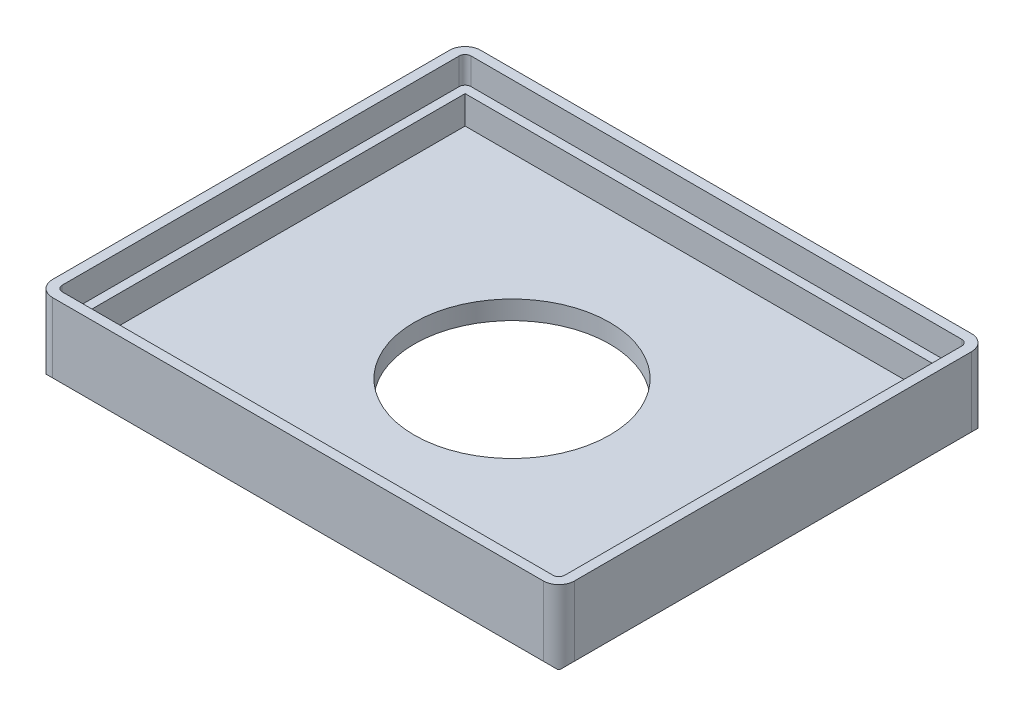
ISO-10303-21;
HEADER;
FILE_DESCRIPTION(('STEP AP214'),'2;1');
FILE_NAME('part.step','',(''),(''),'','','');
FILE_SCHEMA(('AUTOMOTIVE_DESIGN { 1 0 10303 214 1 1 1 1 }'));
ENDSEC;
DATA;
#1=APPLICATION_CONTEXT('core data for automotive mechanical design processes');
#2=APPLICATION_PROTOCOL_DEFINITION('international standard','automotive_design',2000,#1);
#3=PRODUCT_CONTEXT('',#1,'mechanical');
#4=PRODUCT('Part','Part','',(#3));
#5=PRODUCT_RELATED_PRODUCT_CATEGORY('part','',(#4));
#6=PRODUCT_DEFINITION_FORMATION('','',#4);
#7=PRODUCT_DEFINITION_CONTEXT('part definition',#1,'design');
#8=PRODUCT_DEFINITION('design','',#6,#7);
#9=PRODUCT_DEFINITION_SHAPE('','',#8);
#10=(LENGTH_UNIT() NAMED_UNIT(*) SI_UNIT(.MILLI.,.METRE.));
#11=(NAMED_UNIT(*) PLANE_ANGLE_UNIT() SI_UNIT($,.RADIAN.));
#12=(NAMED_UNIT(*) SI_UNIT($,.STERADIAN.) SOLID_ANGLE_UNIT());
#13=UNCERTAINTY_MEASURE_WITH_UNIT(LENGTH_MEASURE(1.E-05),#10,'distance_accuracy_value','');
#14=(GEOMETRIC_REPRESENTATION_CONTEXT(3) GLOBAL_UNCERTAINTY_ASSIGNED_CONTEXT((#13)) GLOBAL_UNIT_ASSIGNED_CONTEXT((#10,
#11,#12)) REPRESENTATION_CONTEXT('',''));
#15=CARTESIAN_POINT('',(0.,0.,0.));
#16=DIRECTION('',(0.,0.,1.));
#17=DIRECTION('',(1.,0.,0.));
#18=AXIS2_PLACEMENT_3D('',#15,#16,#17);
#19=CARTESIAN_POINT('',(0.,6.,0.));
#20=DIRECTION('',(0.,1.,0.));
#21=DIRECTION('',(0.,0.,1.));
#22=AXIS2_PLACEMENT_3D('',#19,#20,#21);
#23=PLANE('',#22);
#24=DIRECTION('',(1.,0.,0.));
#25=VECTOR('',#24,1.);
#26=CARTESIAN_POINT('',(-33.4,6.,25.));
#27=LINE('',#26,#25);
#28=CARTESIAN_POINT('',(-31.,6.,25.));
#29=VERTEX_POINT('',#28);
#30=CARTESIAN_POINT('',(31.,6.,25.));
#31=VERTEX_POINT('',#30);
#32=EDGE_CURVE('E297',#29,#31,#27,.T.);
#33=ORIENTED_EDGE('',*,*,#32,.F.);
#34=DIRECTION('',(0.,0.,1.));
#35=VECTOR('',#34,1.);
#36=CARTESIAN_POINT('',(-31.,6.,-27.4));
#37=LINE('',#36,#35);
#38=CARTESIAN_POINT('',(-31.,6.,-25.));
#39=VERTEX_POINT('',#38);
#40=EDGE_CURVE('E305',#39,#29,#37,.T.);
#41=ORIENTED_EDGE('',*,*,#40,.F.);
#42=DIRECTION('',(-1.,0.,0.));
#43=VECTOR('',#42,1.);
#44=CARTESIAN_POINT('',(-33.4,6.,-25.));
#45=LINE('',#44,#43);
#46=CARTESIAN_POINT('',(31.,6.,-25.));
#47=VERTEX_POINT('',#46);
#48=EDGE_CURVE('E58',#47,#39,#45,.T.);
#49=ORIENTED_EDGE('',*,*,#48,.F.);
#50=DIRECTION('',(0.,0.,-1.));
#51=VECTOR('',#50,1.);
#52=CARTESIAN_POINT('',(31.,6.,-27.4));
#53=LINE('',#52,#51);
#54=EDGE_CURVE('E291',#31,#47,#53,.T.);
#55=ORIENTED_EDGE('',*,*,#54,.F.);
#56=EDGE_LOOP('',(#33,#41,#49,#55));
#57=FACE_BOUND('',#56,.T.);
#58=DIRECTION('',(0.,0.,1.));
#59=VECTOR('',#58,1.);
#60=CARTESIAN_POINT('',(-32.15,6.,-25.4));
#61=LINE('',#60,#59);
#62=CARTESIAN_POINT('',(-32.15,6.,-25.4));
#63=VERTEX_POINT('',#62);
#64=CARTESIAN_POINT('',(-32.15,6.,25.4));
#65=VERTEX_POINT('',#64);
#66=EDGE_CURVE('E206',#63,#65,#61,.T.);
#67=ORIENTED_EDGE('',*,*,#66,.T.);
#68=CARTESIAN_POINT('',(-31.4,6.,25.4));
#69=DIRECTION('',(0.,1.,0.));
#70=DIRECTION('',(0.,0.,1.));
#71=AXIS2_PLACEMENT_3D('',#68,#69,#70);
#72=CIRCLE('',#71,0.750000000000001);
#73=CARTESIAN_POINT('',(-31.4,6.,26.15));
#74=VERTEX_POINT('',#73);
#75=EDGE_CURVE('E235',#65,#74,#72,.T.);
#76=ORIENTED_EDGE('',*,*,#75,.T.);
#77=DIRECTION('',(1.,0.,0.));
#78=VECTOR('',#77,1.);
#79=CARTESIAN_POINT('',(-31.4,6.,26.15));
#80=LINE('',#79,#78);
#81=CARTESIAN_POINT('',(31.4,6.,26.15));
#82=VERTEX_POINT('',#81);
#83=EDGE_CURVE('E212',#74,#82,#80,.T.);
#84=ORIENTED_EDGE('',*,*,#83,.T.);
#85=CARTESIAN_POINT('',(31.4,6.,25.4));
#86=DIRECTION('',(0.,1.,0.));
#87=DIRECTION('',(0.,0.,1.));
#88=AXIS2_PLACEMENT_3D('',#85,#86,#87);
#89=CIRCLE('',#88,0.749999999999997);
#90=CARTESIAN_POINT('',(32.15,6.,25.4));
#91=VERTEX_POINT('',#90);
#92=EDGE_CURVE('E239',#82,#91,#89,.T.);
#93=ORIENTED_EDGE('',*,*,#92,.T.);
#94=DIRECTION('',(0.,0.,-1.));
#95=VECTOR('',#94,1.);
#96=CARTESIAN_POINT('',(32.15,6.,25.4));
#97=LINE('',#96,#95);
#98=CARTESIAN_POINT('',(32.15,6.,-25.4));
#99=VERTEX_POINT('',#98);
#100=EDGE_CURVE('E242',#91,#99,#97,.T.);
#101=ORIENTED_EDGE('',*,*,#100,.T.);
#102=CARTESIAN_POINT('',(31.4,6.,-25.4));
#103=DIRECTION('',(0.,1.,0.));
#104=DIRECTION('',(0.,0.,1.));
#105=AXIS2_PLACEMENT_3D('',#102,#103,#104);
#106=CIRCLE('',#105,0.750000000000001);
#107=CARTESIAN_POINT('',(31.4,6.,-26.15));
#108=VERTEX_POINT('',#107);
#109=EDGE_CURVE('E245',#99,#108,#106,.T.);
#110=ORIENTED_EDGE('',*,*,#109,.T.);
#111=DIRECTION('',(-1.,0.,0.));
#112=VECTOR('',#111,1.);
#113=CARTESIAN_POINT('',(31.4,6.,-26.15));
#114=LINE('',#113,#112);
#115=CARTESIAN_POINT('',(-31.4,6.,-26.15));
#116=VERTEX_POINT('',#115);
#117=EDGE_CURVE('E248',#108,#116,#114,.T.);
#118=ORIENTED_EDGE('',*,*,#117,.T.);
#119=CARTESIAN_POINT('',(-31.4,6.,-25.4));
#120=DIRECTION('',(0.,1.,0.));
#121=DIRECTION('',(0.,0.,1.));
#122=AXIS2_PLACEMENT_3D('',#119,#120,#121);
#123=CIRCLE('',#122,0.749999999999995);
#124=EDGE_CURVE('E251',#116,#63,#123,.T.);
#125=ORIENTED_EDGE('',*,*,#124,.T.);
#126=EDGE_LOOP('',(#67,#76,#84,#93,#101,#110,#118,#125));
#127=FACE_BOUND('',#126,.T.);
#128=ADVANCED_FACE('F35',(#57,#127),#23,.T.);
#129=CARTESIAN_POINT('',(0.,2.4,0.));
#130=DIRECTION('',(0.,1.,0.));
#131=DIRECTION('',(0.,0.,1.));
#132=AXIS2_PLACEMENT_3D('',#129,#130,#131);
#133=PLANE('',#132);
#134=CARTESIAN_POINT('',(0.,2.4,0.));
#135=DIRECTION('',(0.,1.,0.));
#136=DIRECTION('',(0.,0.,1.));
#137=AXIS2_PLACEMENT_3D('',#134,#135,#136);
#138=CIRCLE('',#137,12.5);
#139=CARTESIAN_POINT('',(0.,2.4,12.5));
#140=VERTEX_POINT('',#139);
#141=EDGE_CURVE('E737',#140,#140,#138,.F.);
#142=ORIENTED_EDGE('',*,*,#141,.T.);
#143=EDGE_LOOP('',(#142));
#144=FACE_BOUND('',#143,.T.);
#145=DIRECTION('',(-1.,0.,0.));
#146=VECTOR('',#145,1.);
#147=CARTESIAN_POINT('',(0.,2.4,25.));
#148=LINE('',#147,#146);
#149=CARTESIAN_POINT('',(31.,2.4,25.));
#150=VERTEX_POINT('',#149);
#151=CARTESIAN_POINT('',(-31.,2.4,25.));
#152=VERTEX_POINT('',#151);
#153=EDGE_CURVE('E300',#150,#152,#148,.T.);
#154=ORIENTED_EDGE('',*,*,#153,.F.);
#155=DIRECTION('',(0.,0.,1.));
#156=VECTOR('',#155,1.);
#157=CARTESIAN_POINT('',(31.,2.4,0.));
#158=LINE('',#157,#156);
#159=CARTESIAN_POINT('',(31.,2.4,-25.));
#160=VERTEX_POINT('',#159);
#161=EDGE_CURVE('E311',#160,#150,#158,.T.);
#162=ORIENTED_EDGE('',*,*,#161,.F.);
#163=DIRECTION('',(1.,0.,0.));
#164=VECTOR('',#163,1.);
#165=CARTESIAN_POINT('',(0.,2.4,-25.));
#166=LINE('',#165,#164);
#167=CARTESIAN_POINT('',(-31.,2.4,-25.));
#168=VERTEX_POINT('',#167);
#169=EDGE_CURVE('E313',#168,#160,#166,.T.);
#170=ORIENTED_EDGE('',*,*,#169,.F.);
#171=DIRECTION('',(0.,0.,-1.));
#172=VECTOR('',#171,1.);
#173=CARTESIAN_POINT('',(-31.,2.4,0.));
#174=LINE('',#173,#172);
#175=EDGE_CURVE('E315',#152,#168,#174,.T.);
#176=ORIENTED_EDGE('',*,*,#175,.F.);
#177=EDGE_LOOP('',(#154,#162,#170,#176));
#178=FACE_BOUND('',#177,.T.);
#179=ADVANCED_FACE('F443',(#144,#178),#133,.T.);
#180=CARTESIAN_POINT('',(31.,6.,-27.4));
#181=DIRECTION('',(-1.,0.,0.));
#182=DIRECTION('',(0.,0.,1.));
#183=AXIS2_PLACEMENT_3D('',#180,#181,#182);
#184=PLANE('',#183);
#185=ORIENTED_EDGE('',*,*,#161,.T.);
#186=DIRECTION('',(0.,1.,0.));
#187=VECTOR('',#186,1.);
#188=CARTESIAN_POINT('',(31.,6.,25.));
#189=LINE('',#188,#187);
#190=EDGE_CURVE('E292',#150,#31,#189,.T.);
#191=ORIENTED_EDGE('',*,*,#190,.T.);
#192=ORIENTED_EDGE('',*,*,#54,.T.);
#193=DIRECTION('',(0.,1.,0.));
#194=VECTOR('',#193,1.);
#195=CARTESIAN_POINT('',(31.,6.,-25.));
#196=LINE('',#195,#194);
#197=EDGE_CURVE('E295',#160,#47,#196,.T.);
#198=ORIENTED_EDGE('',*,*,#197,.F.);
#199=EDGE_LOOP('',(#185,#191,#192,#198));
#200=FACE_BOUND('',#199,.T.);
#201=ADVANCED_FACE('F449',(#200),#184,.T.);
#202=CARTESIAN_POINT('',(-33.4,6.,-25.));
#203=DIRECTION('',(0.,0.,1.));
#204=DIRECTION('',(1.,0.,0.));
#205=AXIS2_PLACEMENT_3D('',#202,#203,#204);
#206=PLANE('',#205);
#207=ORIENTED_EDGE('',*,*,#169,.T.);
#208=ORIENTED_EDGE('',*,*,#197,.T.);
#209=ORIENTED_EDGE('',*,*,#48,.T.);
#210=DIRECTION('',(0.,1.,0.));
#211=VECTOR('',#210,1.);
#212=CARTESIAN_POINT('',(-31.,6.,-25.));
#213=LINE('',#212,#211);
#214=EDGE_CURVE('E298',#168,#39,#213,.T.);
#215=ORIENTED_EDGE('',*,*,#214,.F.);
#216=EDGE_LOOP('',(#207,#208,#209,#215));
#217=FACE_BOUND('',#216,.T.);
#218=ADVANCED_FACE('F529',(#217),#206,.T.);
#219=CARTESIAN_POINT('',(-31.,6.,-27.4));
#220=DIRECTION('',(1.,0.,0.));
#221=DIRECTION('',(0.,0.,-1.));
#222=AXIS2_PLACEMENT_3D('',#219,#220,#221);
#223=PLANE('',#222);
#224=ORIENTED_EDGE('',*,*,#175,.T.);
#225=ORIENTED_EDGE('',*,*,#214,.T.);
#226=ORIENTED_EDGE('',*,*,#40,.T.);
#227=DIRECTION('',(0.,1.,0.));
#228=VECTOR('',#227,1.);
#229=CARTESIAN_POINT('',(-31.,6.,25.));
#230=LINE('',#229,#228);
#231=EDGE_CURVE('E294',#152,#29,#230,.T.);
#232=ORIENTED_EDGE('',*,*,#231,.F.);
#233=EDGE_LOOP('',(#224,#225,#226,#232));
#234=FACE_BOUND('',#233,.T.);
#235=ADVANCED_FACE('F537',(#234),#223,.T.);
#236=CARTESIAN_POINT('',(-33.4,6.,25.));
#237=DIRECTION('',(0.,0.,-1.));
#238=DIRECTION('',(-1.,0.,0.));
#239=AXIS2_PLACEMENT_3D('',#236,#237,#238);
#240=PLANE('',#239);
#241=ORIENTED_EDGE('',*,*,#153,.T.);
#242=ORIENTED_EDGE('',*,*,#231,.T.);
#243=ORIENTED_EDGE('',*,*,#32,.T.);
#244=ORIENTED_EDGE('',*,*,#190,.F.);
#245=EDGE_LOOP('',(#241,#242,#243,#244));
#246=FACE_BOUND('',#245,.T.);
#247=ADVANCED_FACE('F544',(#246),#240,.T.);
#248=CARTESIAN_POINT('',(-31.4,9.4,25.4));
#249=DIRECTION('',(0.,1.,0.));
#250=DIRECTION('',(0.,0.,1.));
#251=AXIS2_PLACEMENT_3D('',#248,#249,#250);
#252=PLANE('',#251);
#253=CARTESIAN_POINT('',(-31.4,9.4,25.4));
#254=DIRECTION('',(0.,1.,0.));
#255=DIRECTION('',(0.,0.,1.));
#256=AXIS2_PLACEMENT_3D('',#253,#254,#255);
#257=CIRCLE('',#256,2.);
#258=CARTESIAN_POINT('',(-33.4,9.4,25.4));
#259=VERTEX_POINT('',#258);
#260=CARTESIAN_POINT('',(-31.4,9.4,27.4));
#261=VERTEX_POINT('',#260);
#262=EDGE_CURVE('E213',#259,#261,#257,.T.);
#263=ORIENTED_EDGE('',*,*,#262,.T.);
#264=DIRECTION('',(1.,0.,0.));
#265=VECTOR('',#264,1.);
#266=CARTESIAN_POINT('',(-31.4,9.4,27.4));
#267=LINE('',#266,#265);
#268=CARTESIAN_POINT('',(31.4,9.4,27.4));
#269=VERTEX_POINT('',#268);
#270=EDGE_CURVE('E270',#261,#269,#267,.T.);
#271=ORIENTED_EDGE('',*,*,#270,.T.);
#272=CARTESIAN_POINT('',(31.4,9.4,25.4));
#273=DIRECTION('',(0.,1.,0.));
#274=DIRECTION('',(0.,0.,1.));
#275=AXIS2_PLACEMENT_3D('',#272,#273,#274);
#276=CIRCLE('',#275,2.);
#277=CARTESIAN_POINT('',(33.4,9.4,25.4));
#278=VERTEX_POINT('',#277);
#279=EDGE_CURVE('E273',#269,#278,#276,.T.);
#280=ORIENTED_EDGE('',*,*,#279,.T.);
#281=DIRECTION('',(0.,0.,-1.));
#282=VECTOR('',#281,1.);
#283=CARTESIAN_POINT('',(33.4,9.4,25.4));
#284=LINE('',#283,#282);
#285=CARTESIAN_POINT('',(33.4,9.4,-25.4));
#286=VERTEX_POINT('',#285);
#287=EDGE_CURVE('E276',#278,#286,#284,.T.);
#288=ORIENTED_EDGE('',*,*,#287,.T.);
#289=CARTESIAN_POINT('',(31.4,9.4,-25.4));
#290=DIRECTION('',(0.,1.,0.));
#291=DIRECTION('',(0.,0.,1.));
#292=AXIS2_PLACEMENT_3D('',#289,#290,#291);
#293=CIRCLE('',#292,2.);
#294=CARTESIAN_POINT('',(31.4,9.4,-27.4));
#295=VERTEX_POINT('',#294);
#296=EDGE_CURVE('E279',#286,#295,#293,.T.);
#297=ORIENTED_EDGE('',*,*,#296,.T.);
#298=DIRECTION('',(-1.,0.,0.));
#299=VECTOR('',#298,1.);
#300=CARTESIAN_POINT('',(31.4,9.4,-27.4));
#301=LINE('',#300,#299);
#302=CARTESIAN_POINT('',(-31.4,9.4,-27.4));
#303=VERTEX_POINT('',#302);
#304=EDGE_CURVE('E282',#295,#303,#301,.T.);
#305=ORIENTED_EDGE('',*,*,#304,.T.);
#306=CARTESIAN_POINT('',(-31.4,9.4,-25.4));
#307=DIRECTION('',(0.,1.,0.));
#308=DIRECTION('',(0.,0.,1.));
#309=AXIS2_PLACEMENT_3D('',#306,#307,#308);
#310=CIRCLE('',#309,2.);
#311=CARTESIAN_POINT('',(-33.4,9.4,-25.4));
#312=VERTEX_POINT('',#311);
#313=EDGE_CURVE('E285',#303,#312,#310,.T.);
#314=ORIENTED_EDGE('',*,*,#313,.T.);
#315=DIRECTION('',(0.,0.,1.));
#316=VECTOR('',#315,1.);
#317=CARTESIAN_POINT('',(-33.4,9.4,-25.4));
#318=LINE('',#317,#316);
#319=EDGE_CURVE('E288',#312,#259,#318,.T.);
#320=ORIENTED_EDGE('',*,*,#319,.T.);
#321=EDGE_LOOP('',(#263,#271,#280,#288,#297,#305,#314,#320));
#322=FACE_BOUND('',#321,.T.);
#323=DIRECTION('',(1.,0.,0.));
#324=VECTOR('',#323,1.);
#325=CARTESIAN_POINT('',(-31.4,9.4,26.15));
#326=LINE('',#325,#324);
#327=CARTESIAN_POINT('',(-31.4,9.4,26.15));
#328=VERTEX_POINT('',#327);
#329=CARTESIAN_POINT('',(31.4,9.4,26.15));
#330=VERTEX_POINT('',#329);
#331=EDGE_CURVE('E205',#328,#330,#326,.T.);
#332=ORIENTED_EDGE('',*,*,#331,.F.);
#333=CARTESIAN_POINT('',(-31.4,9.4,25.4));
#334=DIRECTION('',(0.,1.,0.));
#335=DIRECTION('',(0.,0.,1.));
#336=AXIS2_PLACEMENT_3D('',#333,#334,#335);
#337=CIRCLE('',#336,0.750000000000001);
#338=CARTESIAN_POINT('',(-32.15,9.4,25.4));
#339=VERTEX_POINT('',#338);
#340=EDGE_CURVE('E197',#339,#328,#337,.T.);
#341=ORIENTED_EDGE('',*,*,#340,.F.);
#342=DIRECTION('',(0.,0.,1.));
#343=VECTOR('',#342,1.);
#344=CARTESIAN_POINT('',(-32.15,9.4,-25.4));
#345=LINE('',#344,#343);
#346=CARTESIAN_POINT('',(-32.15,9.4,-25.4));
#347=VERTEX_POINT('',#346);
#348=EDGE_CURVE('E233',#347,#339,#345,.T.);
#349=ORIENTED_EDGE('',*,*,#348,.F.);
#350=CARTESIAN_POINT('',(-31.4,9.4,-25.4));
#351=DIRECTION('',(0.,1.,0.));
#352=DIRECTION('',(0.,0.,1.));
#353=AXIS2_PLACEMENT_3D('',#350,#351,#352);
#354=CIRCLE('',#353,0.749999999999995);
#355=CARTESIAN_POINT('',(-31.4,9.4,-26.15));
#356=VERTEX_POINT('',#355);
#357=EDGE_CURVE('E230',#356,#347,#354,.T.);
#358=ORIENTED_EDGE('',*,*,#357,.F.);
#359=DIRECTION('',(-1.,0.,0.));
#360=VECTOR('',#359,1.);
#361=CARTESIAN_POINT('',(31.4,9.4,-26.15));
#362=LINE('',#361,#360);
#363=CARTESIAN_POINT('',(31.4,9.4,-26.15));
#364=VERTEX_POINT('',#363);
#365=EDGE_CURVE('E228',#364,#356,#362,.T.);
#366=ORIENTED_EDGE('',*,*,#365,.F.);
#367=CARTESIAN_POINT('',(31.4,9.4,-25.4));
#368=DIRECTION('',(0.,1.,0.));
#369=DIRECTION('',(0.,0.,1.));
#370=AXIS2_PLACEMENT_3D('',#367,#368,#369);
#371=CIRCLE('',#370,0.750000000000001);
#372=CARTESIAN_POINT('',(32.15,9.4,-25.4));
#373=VERTEX_POINT('',#372);
#374=EDGE_CURVE('E226',#373,#364,#371,.T.);
#375=ORIENTED_EDGE('',*,*,#374,.F.);
#376=DIRECTION('',(0.,0.,-1.));
#377=VECTOR('',#376,1.);
#378=CARTESIAN_POINT('',(32.15,9.4,25.4));
#379=LINE('',#378,#377);
#380=CARTESIAN_POINT('',(32.15,9.4,25.4));
#381=VERTEX_POINT('',#380);
#382=EDGE_CURVE('E221',#381,#373,#379,.T.);
#383=ORIENTED_EDGE('',*,*,#382,.F.);
#384=CARTESIAN_POINT('',(31.4,9.4,25.4));
#385=DIRECTION('',(0.,1.,0.));
#386=DIRECTION('',(0.,0.,1.));
#387=AXIS2_PLACEMENT_3D('',#384,#385,#386);
#388=CIRCLE('',#387,0.749999999999997);
#389=EDGE_CURVE('E219',#330,#381,#388,.T.);
#390=ORIENTED_EDGE('',*,*,#389,.F.);
#391=EDGE_LOOP('',(#332,#341,#349,#358,#366,#375,#383,#390));
#392=FACE_BOUND('',#391,.T.);
#393=ADVANCED_FACE('F217',(#322,#392),#252,.T.);
#394=CARTESIAN_POINT('',(-31.4,9.4,25.4));
#395=DIRECTION('',(0.,-1.,0.));
#396=DIRECTION('',(0.,0.,-1.));
#397=AXIS2_PLACEMENT_3D('',#394,#395,#396);
#398=CYLINDRICAL_SURFACE('',#397,0.750000000000001);
#399=ORIENTED_EDGE('',*,*,#75,.F.);
#400=DIRECTION('',(0.,-1.,0.));
#401=VECTOR('',#400,1.);
#402=CARTESIAN_POINT('',(-32.15,9.4,25.4));
#403=LINE('',#402,#401);
#404=EDGE_CURVE('E50',#339,#65,#403,.T.);
#405=ORIENTED_EDGE('',*,*,#404,.F.);
#406=ORIENTED_EDGE('',*,*,#340,.T.);
#407=DIRECTION('',(0.,-1.,0.));
#408=VECTOR('',#407,1.);
#409=CARTESIAN_POINT('',(-31.4,9.4,26.15));
#410=LINE('',#409,#408);
#411=EDGE_CURVE('E200',#328,#74,#410,.T.);
#412=ORIENTED_EDGE('',*,*,#411,.T.);
#413=EDGE_LOOP('',(#399,#405,#406,#412));
#414=FACE_BOUND('',#413,.T.);
#415=ADVANCED_FACE('F199',(#414),#398,.F.);
#416=CARTESIAN_POINT('',(-31.4,9.4,26.15));
#417=DIRECTION('',(0.,0.,-1.));
#418=DIRECTION('',(-1.,0.,0.));
#419=AXIS2_PLACEMENT_3D('',#416,#417,#418);
#420=PLANE('',#419);
#421=ORIENTED_EDGE('',*,*,#83,.F.);
#422=ORIENTED_EDGE('',*,*,#411,.F.);
#423=ORIENTED_EDGE('',*,*,#331,.T.);
#424=DIRECTION('',(0.,-1.,0.));
#425=VECTOR('',#424,1.);
#426=CARTESIAN_POINT('',(31.4,9.4,26.15));
#427=LINE('',#426,#425);
#428=EDGE_CURVE('E214',#330,#82,#427,.T.);
#429=ORIENTED_EDGE('',*,*,#428,.T.);
#430=EDGE_LOOP('',(#421,#422,#423,#429));
#431=FACE_BOUND('',#430,.T.);
#432=ADVANCED_FACE('F209',(#431),#420,.T.);
#433=CARTESIAN_POINT('',(31.4,9.4,25.4));
#434=DIRECTION('',(0.,-1.,0.));
#435=DIRECTION('',(0.,0.,-1.));
#436=AXIS2_PLACEMENT_3D('',#433,#434,#435);
#437=CYLINDRICAL_SURFACE('',#436,0.749999999999997);
#438=ORIENTED_EDGE('',*,*,#92,.F.);
#439=ORIENTED_EDGE('',*,*,#428,.F.);
#440=ORIENTED_EDGE('',*,*,#389,.T.);
#441=DIRECTION('',(0.,-1.,0.));
#442=VECTOR('',#441,1.);
#443=CARTESIAN_POINT('',(32.15,9.4,25.4));
#444=LINE('',#443,#442);
#445=EDGE_CURVE('E265',#381,#91,#444,.T.);
#446=ORIENTED_EDGE('',*,*,#445,.T.);
#447=EDGE_LOOP('',(#438,#439,#440,#446));
#448=FACE_BOUND('',#447,.T.);
#449=ADVANCED_FACE('F569',(#448),#437,.F.);
#450=CARTESIAN_POINT('',(32.15,9.4,25.4));
#451=DIRECTION('',(-1.,0.,0.));
#452=DIRECTION('',(0.,0.,1.));
#453=AXIS2_PLACEMENT_3D('',#450,#451,#452);
#454=PLANE('',#453);
#455=ORIENTED_EDGE('',*,*,#100,.F.);
#456=ORIENTED_EDGE('',*,*,#445,.F.);
#457=ORIENTED_EDGE('',*,*,#382,.T.);
#458=DIRECTION('',(0.,-1.,0.));
#459=VECTOR('',#458,1.);
#460=CARTESIAN_POINT('',(32.15,9.4,-25.4));
#461=LINE('',#460,#459);
#462=EDGE_CURVE('E263',#373,#99,#461,.T.);
#463=ORIENTED_EDGE('',*,*,#462,.T.);
#464=EDGE_LOOP('',(#455,#456,#457,#463));
#465=FACE_BOUND('',#464,.T.);
#466=ADVANCED_FACE('F576',(#465),#454,.T.);
#467=CARTESIAN_POINT('',(31.4,9.4,-25.4));
#468=DIRECTION('',(0.,-1.,0.));
#469=DIRECTION('',(0.,0.,-1.));
#470=AXIS2_PLACEMENT_3D('',#467,#468,#469);
#471=CYLINDRICAL_SURFACE('',#470,0.750000000000001);
#472=ORIENTED_EDGE('',*,*,#109,.F.);
#473=ORIENTED_EDGE('',*,*,#462,.F.);
#474=ORIENTED_EDGE('',*,*,#374,.T.);
#475=DIRECTION('',(0.,-1.,0.));
#476=VECTOR('',#475,1.);
#477=CARTESIAN_POINT('',(31.4,9.4,-26.15));
#478=LINE('',#477,#476);
#479=EDGE_CURVE('E261',#364,#108,#478,.T.);
#480=ORIENTED_EDGE('',*,*,#479,.T.);
#481=EDGE_LOOP('',(#472,#473,#474,#480));
#482=FACE_BOUND('',#481,.T.);
#483=ADVANCED_FACE('F584',(#482),#471,.F.);
#484=CARTESIAN_POINT('',(31.4,9.4,-26.15));
#485=DIRECTION('',(0.,0.,1.));
#486=DIRECTION('',(1.,0.,0.));
#487=AXIS2_PLACEMENT_3D('',#484,#485,#486);
#488=PLANE('',#487);
#489=ORIENTED_EDGE('',*,*,#117,.F.);
#490=ORIENTED_EDGE('',*,*,#479,.F.);
#491=ORIENTED_EDGE('',*,*,#365,.T.);
#492=DIRECTION('',(0.,-1.,0.));
#493=VECTOR('',#492,1.);
#494=CARTESIAN_POINT('',(-31.4,9.4,-26.15));
#495=LINE('',#494,#493);
#496=EDGE_CURVE('E259',#356,#116,#495,.T.);
#497=ORIENTED_EDGE('',*,*,#496,.T.);
#498=EDGE_LOOP('',(#489,#490,#491,#497));
#499=FACE_BOUND('',#498,.T.);
#500=ADVANCED_FACE('F592',(#499),#488,.T.);
#501=CARTESIAN_POINT('',(-31.4,9.4,-25.4));
#502=DIRECTION('',(0.,-1.,0.));
#503=DIRECTION('',(0.,0.,-1.));
#504=AXIS2_PLACEMENT_3D('',#501,#502,#503);
#505=CYLINDRICAL_SURFACE('',#504,0.749999999999995);
#506=ORIENTED_EDGE('',*,*,#124,.F.);
#507=ORIENTED_EDGE('',*,*,#496,.F.);
#508=ORIENTED_EDGE('',*,*,#357,.T.);
#509=DIRECTION('',(0.,-1.,0.));
#510=VECTOR('',#509,1.);
#511=CARTESIAN_POINT('',(-32.15,9.4,-25.4));
#512=LINE('',#511,#510);
#513=EDGE_CURVE('E257',#347,#63,#512,.T.);
#514=ORIENTED_EDGE('',*,*,#513,.T.);
#515=EDGE_LOOP('',(#506,#507,#508,#514));
#516=FACE_BOUND('',#515,.T.);
#517=ADVANCED_FACE('F476',(#516),#505,.F.);
#518=CARTESIAN_POINT('',(-32.15,9.4,-25.4));
#519=DIRECTION('',(1.,0.,0.));
#520=DIRECTION('',(0.,0.,-1.));
#521=AXIS2_PLACEMENT_3D('',#518,#519,#520);
#522=PLANE('',#521);
#523=ORIENTED_EDGE('',*,*,#66,.F.);
#524=ORIENTED_EDGE('',*,*,#513,.F.);
#525=ORIENTED_EDGE('',*,*,#348,.T.);
#526=ORIENTED_EDGE('',*,*,#404,.T.);
#527=EDGE_LOOP('',(#523,#524,#525,#526));
#528=FACE_BOUND('',#527,.T.);
#529=ADVANCED_FACE('F472',(#528),#522,.T.);
#530=CARTESIAN_POINT('',(33.4,0.5,-27.4));
#531=DIRECTION('',(-0.707106781186547,0.707106781186547,0.));
#532=DIRECTION('',(0.,0.,-1.));
#533=AXIS2_PLACEMENT_3D('',#530,#531,#532);
#534=PLANE('',#533);
#535=DIRECTION('',(0.,0.,-1.));
#536=VECTOR('',#535,1.);
#537=CARTESIAN_POINT('',(33.4,0.5,-27.4));
#538=LINE('',#537,#536);
#539=CARTESIAN_POINT('',(33.4,0.5,25.4));
#540=VERTEX_POINT('',#539);
#541=CARTESIAN_POINT('',(33.4,0.5,-25.4));
#542=VERTEX_POINT('',#541);
#543=EDGE_CURVE('E339',#540,#542,#538,.T.);
#544=ORIENTED_EDGE('',*,*,#543,.F.);
#545=CARTESIAN_POINT('',(31.4,-1.5,25.4));
#546=DIRECTION('',(-0.707106781186547,0.707106781186547,0.));
#547=DIRECTION('',(-0.707106781186548,-0.707106781186548,0.));
#548=AXIS2_PLACEMENT_3D('',#545,#546,#547);
#549=ELLIPSE('',#548,2.82842712474619,2.);
#550=CARTESIAN_POINT('',(32.9,0.,26.7228756555323));
#551=VERTEX_POINT('',#550);
#552=EDGE_CURVE('E349',#540,#551,#549,.F.);
#553=ORIENTED_EDGE('',*,*,#552,.T.);
#554=DIRECTION('',(0.,0.,1.));
#555=VECTOR('',#554,1.);
#556=CARTESIAN_POINT('',(32.9,0.,0.));
#557=LINE('',#556,#555);
#558=CARTESIAN_POINT('',(32.9,0.,-26.7228756555323));
#559=VERTEX_POINT('',#558);
#560=EDGE_CURVE('E321',#559,#551,#557,.T.);
#561=ORIENTED_EDGE('',*,*,#560,.F.);
#562=CARTESIAN_POINT('',(31.4,-1.5,-25.4));
#563=DIRECTION('',(-0.707106781186547,0.707106781186547,0.));
#564=DIRECTION('',(-0.707106781186548,-0.707106781186548,0.));
#565=AXIS2_PLACEMENT_3D('',#562,#563,#564);
#566=ELLIPSE('',#565,2.82842712474619,2.);
#567=EDGE_CURVE('E347',#559,#542,#566,.F.);
#568=ORIENTED_EDGE('',*,*,#567,.T.);
#569=EDGE_LOOP('',(#544,#553,#561,#568));
#570=FACE_BOUND('',#569,.T.);
#571=ADVANCED_FACE('F418',(#570),#534,.F.);
#572=CARTESIAN_POINT('',(-33.4,0.5,-27.4));
#573=DIRECTION('',(0.,0.707106781186547,0.707106781186547));
#574=DIRECTION('',(-1.,0.,0.));
#575=AXIS2_PLACEMENT_3D('',#572,#573,#574);
#576=PLANE('',#575);
#577=DIRECTION('',(-1.,0.,0.));
#578=VECTOR('',#577,1.);
#579=CARTESIAN_POINT('',(-33.4,0.5,-27.4));
#580=LINE('',#579,#578);
#581=CARTESIAN_POINT('',(31.4,0.5,-27.4));
#582=VERTEX_POINT('',#581);
#583=CARTESIAN_POINT('',(-31.4,0.5,-27.4));
#584=VERTEX_POINT('',#583);
#585=EDGE_CURVE('E318',#582,#584,#580,.T.);
#586=ORIENTED_EDGE('',*,*,#585,.F.);
#587=CARTESIAN_POINT('',(31.4,-1.5,-25.4));
#588=DIRECTION('',(0.,0.707106781186547,0.707106781186547));
#589=DIRECTION('',(0.,-0.707106781186548,0.707106781186548));
#590=AXIS2_PLACEMENT_3D('',#587,#588,#589);
#591=ELLIPSE('',#590,2.82842712474619,2.);
#592=CARTESIAN_POINT('',(32.7228756555323,0.,-26.9));
#593=VERTEX_POINT('',#592);
#594=EDGE_CURVE('E11',#582,#593,#591,.F.);
#595=ORIENTED_EDGE('',*,*,#594,.T.);
#596=DIRECTION('',(1.,0.,0.));
#597=VECTOR('',#596,1.);
#598=CARTESIAN_POINT('',(0.,0.,-26.9));
#599=LINE('',#598,#597);
#600=CARTESIAN_POINT('',(-32.7228756555323,0.,-26.9));
#601=VERTEX_POINT('',#600);
#602=EDGE_CURVE('E330',#601,#593,#599,.T.);
#603=ORIENTED_EDGE('',*,*,#602,.F.);
#604=CARTESIAN_POINT('',(-31.4,-1.5,-25.4));
#605=DIRECTION('',(0.,0.707106781186547,0.707106781186547));
#606=DIRECTION('',(0.,-0.707106781186548,0.707106781186548));
#607=AXIS2_PLACEMENT_3D('',#604,#605,#606);
#608=ELLIPSE('',#607,2.82842712474619,2.);
#609=EDGE_CURVE('E43',#601,#584,#608,.F.);
#610=ORIENTED_EDGE('',*,*,#609,.T.);
#611=EDGE_LOOP('',(#586,#595,#603,#610));
#612=FACE_BOUND('',#611,.T.);
#613=ADVANCED_FACE('F385',(#612),#576,.F.);
#614=CARTESIAN_POINT('',(-33.4,0.5,27.4));
#615=DIRECTION('',(0.,0.707106781186547,-0.707106781186547));
#616=DIRECTION('',(1.,0.,0.));
#617=AXIS2_PLACEMENT_3D('',#614,#615,#616);
#618=PLANE('',#617);
#619=DIRECTION('',(-1.,0.,0.));
#620=VECTOR('',#619,1.);
#621=CARTESIAN_POINT('',(0.,0.,26.9));
#622=LINE('',#621,#620);
#623=CARTESIAN_POINT('',(32.7228756555323,0.,26.9));
#624=VERTEX_POINT('',#623);
#625=CARTESIAN_POINT('',(-32.7228756555323,0.,26.9));
#626=VERTEX_POINT('',#625);
#627=EDGE_CURVE('E324',#624,#626,#622,.T.);
#628=ORIENTED_EDGE('',*,*,#627,.F.);
#629=CARTESIAN_POINT('',(31.4,-1.49999999999999,25.4));
#630=DIRECTION('',(0.,0.707106781186547,-0.707106781186547));
#631=DIRECTION('',(0.,-0.707106781186548,-0.707106781186548));
#632=AXIS2_PLACEMENT_3D('',#629,#630,#631);
#633=ELLIPSE('',#632,2.82842712474619,2.);
#634=CARTESIAN_POINT('',(31.4,0.5,27.4));
#635=VERTEX_POINT('',#634);
#636=EDGE_CURVE('E361',#624,#635,#633,.F.);
#637=ORIENTED_EDGE('',*,*,#636,.T.);
#638=DIRECTION('',(1.,0.,0.));
#639=VECTOR('',#638,1.);
#640=CARTESIAN_POINT('',(-33.4,0.5,27.4));
#641=LINE('',#640,#639);
#642=CARTESIAN_POINT('',(-31.4,0.5,27.4));
#643=VERTEX_POINT('',#642);
#644=EDGE_CURVE('E336',#643,#635,#641,.T.);
#645=ORIENTED_EDGE('',*,*,#644,.F.);
#646=CARTESIAN_POINT('',(-31.4,-1.5,25.4));
#647=DIRECTION('',(0.,0.707106781186547,-0.707106781186547));
#648=DIRECTION('',(0.,-0.707106781186548,-0.707106781186548));
#649=AXIS2_PLACEMENT_3D('',#646,#647,#648);
#650=ELLIPSE('',#649,2.82842712474619,2.);
#651=EDGE_CURVE('E359',#643,#626,#650,.F.);
#652=ORIENTED_EDGE('',*,*,#651,.T.);
#653=EDGE_LOOP('',(#628,#637,#645,#652));
#654=FACE_BOUND('',#653,.T.);
#655=ADVANCED_FACE('F437',(#654),#618,.F.);
#656=CARTESIAN_POINT('',(0.,0.,0.));
#657=DIRECTION('',(0.,1.,0.));
#658=DIRECTION('',(0.,0.,1.));
#659=AXIS2_PLACEMENT_3D('',#656,#657,#658);
#660=PLANE('',#659);
#661=CARTESIAN_POINT('',(0.,0.,0.));
#662=DIRECTION('',(0.,-1.,0.));
#663=DIRECTION('',(0.,0.,-1.));
#664=AXIS2_PLACEMENT_3D('',#661,#662,#663);
#665=CIRCLE('',#664,12.5);
#666=CARTESIAN_POINT('',(0.,0.,-12.5));
#667=VERTEX_POINT('',#666);
#668=EDGE_CURVE('E237',#667,#667,#665,.T.);
#669=ORIENTED_EDGE('',*,*,#668,.F.);
#670=EDGE_LOOP('',(#669));
#671=FACE_BOUND('',#670,.T.);
#672=ORIENTED_EDGE('',*,*,#560,.T.);
#673=CARTESIAN_POINT('',(31.4,0.,25.4));
#674=DIRECTION('',(0.,1.,0.));
#675=DIRECTION('',(0.,0.,1.));
#676=AXIS2_PLACEMENT_3D('',#673,#674,#675);
#677=CIRCLE('',#676,2.);
#678=EDGE_CURVE('E357',#551,#624,#677,.F.);
#679=ORIENTED_EDGE('',*,*,#678,.T.);
#680=ORIENTED_EDGE('',*,*,#627,.T.);
#681=CARTESIAN_POINT('',(-31.4,0.,25.4));
#682=DIRECTION('',(0.,1.,0.));
#683=DIRECTION('',(0.,0.,1.));
#684=AXIS2_PLACEMENT_3D('',#681,#682,#683);
#685=CIRCLE('',#684,2.);
#686=CARTESIAN_POINT('',(-32.9,0.,26.7228756555323));
#687=VERTEX_POINT('',#686);
#688=EDGE_CURVE('E355',#626,#687,#685,.F.);
#689=ORIENTED_EDGE('',*,*,#688,.T.);
#690=DIRECTION('',(0.,0.,-1.));
#691=VECTOR('',#690,1.);
#692=CARTESIAN_POINT('',(-32.9,0.,0.));
#693=LINE('',#692,#691);
#694=CARTESIAN_POINT('',(-32.9,0.,-26.7228756555323));
#695=VERTEX_POINT('',#694);
#696=EDGE_CURVE('E327',#687,#695,#693,.T.);
#697=ORIENTED_EDGE('',*,*,#696,.T.);
#698=CARTESIAN_POINT('',(-31.4,0.,-25.4));
#699=DIRECTION('',(0.,1.,0.));
#700=DIRECTION('',(0.,0.,1.));
#701=AXIS2_PLACEMENT_3D('',#698,#699,#700);
#702=CIRCLE('',#701,2.);
#703=EDGE_CURVE('E351',#695,#601,#702,.F.);
#704=ORIENTED_EDGE('',*,*,#703,.T.);
#705=ORIENTED_EDGE('',*,*,#602,.T.);
#706=CARTESIAN_POINT('',(31.4,0.,-25.4));
#707=DIRECTION('',(0.,1.,0.));
#708=DIRECTION('',(0.,0.,1.));
#709=AXIS2_PLACEMENT_3D('',#706,#707,#708);
#710=CIRCLE('',#709,2.);
#711=EDGE_CURVE('E353',#593,#559,#710,.F.);
#712=ORIENTED_EDGE('',*,*,#711,.T.);
#713=EDGE_LOOP('',(#672,#679,#680,#689,#697,#704,#705,#712));
#714=FACE_BOUND('',#713,.T.);
#715=ADVANCED_FACE('F426',(#671,#714),#660,.F.);
#716=CARTESIAN_POINT('',(-33.4,0.5,-27.4));
#717=DIRECTION('',(0.707106781186547,0.707106781186547,0.));
#718=DIRECTION('',(0.,0.,1.));
#719=AXIS2_PLACEMENT_3D('',#716,#717,#718);
#720=PLANE('',#719);
#721=ORIENTED_EDGE('',*,*,#696,.F.);
#722=CARTESIAN_POINT('',(-31.4,-1.5,25.4));
#723=DIRECTION('',(0.707106781186547,0.707106781186547,0.));
#724=DIRECTION('',(0.707106781186548,-0.707106781186548,0.));
#725=AXIS2_PLACEMENT_3D('',#722,#723,#724);
#726=ELLIPSE('',#725,2.82842712474619,2.);
#727=CARTESIAN_POINT('',(-33.4,0.5,25.4));
#728=VERTEX_POINT('',#727);
#729=EDGE_CURVE('E370',#687,#728,#726,.F.);
#730=ORIENTED_EDGE('',*,*,#729,.T.);
#731=DIRECTION('',(0.,0.,1.));
#732=VECTOR('',#731,1.);
#733=CARTESIAN_POINT('',(-33.4,0.5,-27.4));
#734=LINE('',#733,#732);
#735=CARTESIAN_POINT('',(-33.4,0.5,-25.4));
#736=VERTEX_POINT('',#735);
#737=EDGE_CURVE('E333',#736,#728,#734,.T.);
#738=ORIENTED_EDGE('',*,*,#737,.F.);
#739=CARTESIAN_POINT('',(-31.4,-1.5,-25.4));
#740=DIRECTION('',(0.707106781186547,0.707106781186547,0.));
#741=DIRECTION('',(0.707106781186548,-0.707106781186548,0.));
#742=AXIS2_PLACEMENT_3D('',#739,#740,#741);
#743=ELLIPSE('',#742,2.82842712474619,2.);
#744=EDGE_CURVE('E368',#736,#695,#743,.F.);
#745=ORIENTED_EDGE('',*,*,#744,.T.);
#746=EDGE_LOOP('',(#721,#730,#738,#745));
#747=FACE_BOUND('',#746,.T.);
#748=ADVANCED_FACE('F429',(#747),#720,.F.);
#749=CARTESIAN_POINT('',(-31.4,6.,25.4));
#750=DIRECTION('',(0.,-1.,0.));
#751=DIRECTION('',(0.,0.,-1.));
#752=AXIS2_PLACEMENT_3D('',#749,#750,#751);
#753=CYLINDRICAL_SURFACE('',#752,2.);
#754=DIRECTION('',(0.,-1.,0.));
#755=VECTOR('',#754,1.);
#756=CARTESIAN_POINT('',(-31.4,6.,27.4));
#757=LINE('',#756,#755);
#758=EDGE_CURVE('E363',#261,#643,#757,.T.);
#759=ORIENTED_EDGE('',*,*,#758,.F.);
#760=ORIENTED_EDGE('',*,*,#262,.F.);
#761=DIRECTION('',(0.,-1.,0.));
#762=VECTOR('',#761,1.);
#763=CARTESIAN_POINT('',(-33.4,6.,25.4));
#764=LINE('',#763,#762);
#765=EDGE_CURVE('E375',#728,#259,#764,.F.);
#766=ORIENTED_EDGE('',*,*,#765,.F.);
#767=ORIENTED_EDGE('',*,*,#729,.F.);
#768=ORIENTED_EDGE('',*,*,#688,.F.);
#769=ORIENTED_EDGE('',*,*,#651,.F.);
#770=EDGE_LOOP('',(#759,#760,#766,#767,#768,#769));
#771=FACE_BOUND('',#770,.T.);
#772=ADVANCED_FACE('F402',(#771),#753,.T.);
#773=CARTESIAN_POINT('',(-33.4,6.,-27.4));
#774=DIRECTION('',(1.,0.,0.));
#775=DIRECTION('',(0.,0.,-1.));
#776=AXIS2_PLACEMENT_3D('',#773,#774,#775);
#777=PLANE('',#776);
#778=ORIENTED_EDGE('',*,*,#737,.T.);
#779=ORIENTED_EDGE('',*,*,#765,.T.);
#780=ORIENTED_EDGE('',*,*,#319,.F.);
#781=DIRECTION('',(0.,-1.,0.));
#782=VECTOR('',#781,1.);
#783=CARTESIAN_POINT('',(-33.4,6.,-25.4));
#784=LINE('',#783,#782);
#785=EDGE_CURVE('E372',#312,#736,#784,.T.);
#786=ORIENTED_EDGE('',*,*,#785,.T.);
#787=EDGE_LOOP('',(#778,#779,#780,#786));
#788=FACE_BOUND('',#787,.T.);
#789=ADVANCED_FACE('F397',(#788),#777,.F.);
#790=CARTESIAN_POINT('',(-31.4,6.,-25.4));
#791=DIRECTION('',(0.,-1.,0.));
#792=DIRECTION('',(0.,0.,-1.));
#793=AXIS2_PLACEMENT_3D('',#790,#791,#792);
#794=CYLINDRICAL_SURFACE('',#793,2.);
#795=ORIENTED_EDGE('',*,*,#785,.F.);
#796=ORIENTED_EDGE('',*,*,#313,.F.);
#797=DIRECTION('',(0.,-1.,0.));
#798=VECTOR('',#797,1.);
#799=CARTESIAN_POINT('',(-31.4,6.,-27.4));
#800=LINE('',#799,#798);
#801=EDGE_CURVE('E377',#584,#303,#800,.F.);
#802=ORIENTED_EDGE('',*,*,#801,.F.);
#803=ORIENTED_EDGE('',*,*,#609,.F.);
#804=ORIENTED_EDGE('',*,*,#703,.F.);
#805=ORIENTED_EDGE('',*,*,#744,.F.);
#806=EDGE_LOOP('',(#795,#796,#802,#803,#804,#805));
#807=FACE_BOUND('',#806,.T.);
#808=ADVANCED_FACE('F37',(#807),#794,.T.);
#809=CARTESIAN_POINT('',(-33.4,6.,-27.4));
#810=DIRECTION('',(0.,0.,1.));
#811=DIRECTION('',(1.,0.,0.));
#812=AXIS2_PLACEMENT_3D('',#809,#810,#811);
#813=PLANE('',#812);
#814=ORIENTED_EDGE('',*,*,#801,.T.);
#815=ORIENTED_EDGE('',*,*,#304,.F.);
#816=DIRECTION('',(0.,-1.,0.));
#817=VECTOR('',#816,1.);
#818=CARTESIAN_POINT('',(31.4,6.,-27.4));
#819=LINE('',#818,#817);
#820=EDGE_CURVE('E379',#295,#582,#819,.T.);
#821=ORIENTED_EDGE('',*,*,#820,.T.);
#822=ORIENTED_EDGE('',*,*,#585,.T.);
#823=EDGE_LOOP('',(#814,#815,#821,#822));
#824=FACE_BOUND('',#823,.T.);
#825=ADVANCED_FACE('F390',(#824),#813,.F.);
#826=CARTESIAN_POINT('',(31.4,6.,-25.4));
#827=DIRECTION('',(0.,-1.,0.));
#828=DIRECTION('',(0.,0.,-1.));
#829=AXIS2_PLACEMENT_3D('',#826,#827,#828);
#830=CYLINDRICAL_SURFACE('',#829,2.);
#831=ORIENTED_EDGE('',*,*,#820,.F.);
#832=ORIENTED_EDGE('',*,*,#296,.F.);
#833=DIRECTION('',(0.,-1.,0.));
#834=VECTOR('',#833,1.);
#835=CARTESIAN_POINT('',(33.4,6.,-25.4));
#836=LINE('',#835,#834);
#837=EDGE_CURVE('E342',#542,#286,#836,.F.);
#838=ORIENTED_EDGE('',*,*,#837,.F.);
#839=ORIENTED_EDGE('',*,*,#567,.F.);
#840=ORIENTED_EDGE('',*,*,#711,.F.);
#841=ORIENTED_EDGE('',*,*,#594,.F.);
#842=EDGE_LOOP('',(#831,#832,#838,#839,#840,#841));
#843=FACE_BOUND('',#842,.T.);
#844=ADVANCED_FACE('F423',(#843),#830,.T.);
#845=CARTESIAN_POINT('',(33.4,6.,-27.4));
#846=DIRECTION('',(-1.,0.,0.));
#847=DIRECTION('',(0.,0.,1.));
#848=AXIS2_PLACEMENT_3D('',#845,#846,#847);
#849=PLANE('',#848);
#850=ORIENTED_EDGE('',*,*,#837,.T.);
#851=ORIENTED_EDGE('',*,*,#287,.F.);
#852=DIRECTION('',(0.,-1.,0.));
#853=VECTOR('',#852,1.);
#854=CARTESIAN_POINT('',(33.4,6.,25.4));
#855=LINE('',#854,#853);
#856=EDGE_CURVE('E344',#278,#540,#855,.T.);
#857=ORIENTED_EDGE('',*,*,#856,.T.);
#858=ORIENTED_EDGE('',*,*,#543,.T.);
#859=EDGE_LOOP('',(#850,#851,#857,#858));
#860=FACE_BOUND('',#859,.T.);
#861=ADVANCED_FACE('F415',(#860),#849,.F.);
#862=CARTESIAN_POINT('',(31.4,6.,25.4));
#863=DIRECTION('',(0.,-1.,0.));
#864=DIRECTION('',(0.,0.,-1.));
#865=AXIS2_PLACEMENT_3D('',#862,#863,#864);
#866=CYLINDRICAL_SURFACE('',#865,2.);
#867=ORIENTED_EDGE('',*,*,#856,.F.);
#868=ORIENTED_EDGE('',*,*,#279,.F.);
#869=DIRECTION('',(0.,-1.,0.));
#870=VECTOR('',#869,1.);
#871=CARTESIAN_POINT('',(31.4,6.,27.4));
#872=LINE('',#871,#870);
#873=EDGE_CURVE('E366',#635,#269,#872,.F.);
#874=ORIENTED_EDGE('',*,*,#873,.F.);
#875=ORIENTED_EDGE('',*,*,#636,.F.);
#876=ORIENTED_EDGE('',*,*,#678,.F.);
#877=ORIENTED_EDGE('',*,*,#552,.F.);
#878=EDGE_LOOP('',(#867,#868,#874,#875,#876,#877));
#879=FACE_BOUND('',#878,.T.);
#880=ADVANCED_FACE('F410',(#879),#866,.T.);
#881=CARTESIAN_POINT('',(-33.4,6.,27.4));
#882=DIRECTION('',(0.,0.,-1.));
#883=DIRECTION('',(-1.,0.,0.));
#884=AXIS2_PLACEMENT_3D('',#881,#882,#883);
#885=PLANE('',#884);
#886=ORIENTED_EDGE('',*,*,#644,.T.);
#887=ORIENTED_EDGE('',*,*,#873,.T.);
#888=ORIENTED_EDGE('',*,*,#270,.F.);
#889=ORIENTED_EDGE('',*,*,#758,.T.);
#890=EDGE_LOOP('',(#886,#887,#888,#889));
#891=FACE_BOUND('',#890,.T.);
#892=ADVANCED_FACE('F456',(#891),#885,.F.);
#893=CARTESIAN_POINT('',(0.,9.401,0.));
#894=DIRECTION('',(0.,-1.,0.));
#895=DIRECTION('',(0.,0.,-1.));
#896=AXIS2_PLACEMENT_3D('',#893,#894,#895);
#897=CYLINDRICAL_SURFACE('',#896,12.5);
#898=ORIENTED_EDGE('',*,*,#141,.F.);
#899=EDGE_LOOP('',(#898));
#900=FACE_BOUND('',#899,.T.);
#901=ORIENTED_EDGE('',*,*,#668,.T.);
#902=EDGE_LOOP('',(#901));
#903=FACE_BOUND('',#902,.T.);
#904=ADVANCED_FACE('F459',(#900,#903),#897,.F.);
#905=CLOSED_SHELL('',(#128,#179,#201,#218,#235,#247,#393,#415,#432,#449,#466,#483,#500,#517,
#529,#571,#613,#655,#715,#748,#772,#789,#808,#825,#844,#861,#880,#892,#904));
#906=MANIFOLD_SOLID_BREP('B2',#905);
#907=ADVANCED_BREP_SHAPE_REPRESENTATION('',(#18,#906),#14);
#908=SHAPE_DEFINITION_REPRESENTATION(#9,#907);
ENDSEC;
END-ISO-10303-21;
